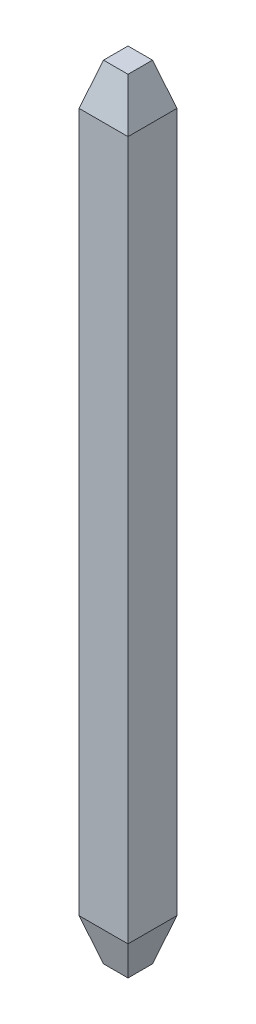
ISO-10303-21;
HEADER;
FILE_DESCRIPTION(('STEP AP214'),'2;1');
FILE_NAME('part.step','',(''),(''),'','','');
FILE_SCHEMA(('AUTOMOTIVE_DESIGN { 1 0 10303 214 1 1 1 1 }'));
ENDSEC;
DATA;
#1=APPLICATION_CONTEXT('core data for automotive mechanical design processes');
#2=APPLICATION_PROTOCOL_DEFINITION('international standard','automotive_design',2000,#1);
#3=PRODUCT_CONTEXT('',#1,'mechanical');
#4=PRODUCT('Part','Part','',(#3));
#5=PRODUCT_RELATED_PRODUCT_CATEGORY('part','',(#4));
#6=PRODUCT_DEFINITION_FORMATION('','',#4);
#7=PRODUCT_DEFINITION_CONTEXT('part definition',#1,'design');
#8=PRODUCT_DEFINITION('design','',#6,#7);
#9=PRODUCT_DEFINITION_SHAPE('','',#8);
#10=(LENGTH_UNIT() NAMED_UNIT(*) SI_UNIT(.MILLI.,.METRE.));
#11=(NAMED_UNIT(*) PLANE_ANGLE_UNIT() SI_UNIT($,.RADIAN.));
#12=(NAMED_UNIT(*) SI_UNIT($,.STERADIAN.) SOLID_ANGLE_UNIT());
#13=UNCERTAINTY_MEASURE_WITH_UNIT(LENGTH_MEASURE(1.E-05),#10,'distance_accuracy_value','');
#14=(GEOMETRIC_REPRESENTATION_CONTEXT(3) GLOBAL_UNCERTAINTY_ASSIGNED_CONTEXT((#13)) GLOBAL_UNIT_ASSIGNED_CONTEXT((#10,
#11,#12)) REPRESENTATION_CONTEXT('',''));
#15=CARTESIAN_POINT('',(0.,0.,0.));
#16=DIRECTION('',(0.,0.,1.));
#17=DIRECTION('',(1.,0.,0.));
#18=AXIS2_PLACEMENT_3D('',#15,#16,#17);
#19=CARTESIAN_POINT('',(-13.489999999987,-10.1039999999832,-19.5199999999763));
#20=DIRECTION('',(0.959644900900969,-0.28121462297464,0.));
#21=DIRECTION('',(0.,0.,-1.));
#22=AXIS2_PLACEMENT_3D('',#19,#20,#21);
#23=PLANE('',#22);
#24=DIRECTION('',(0.,0.,1.));
#25=VECTOR('',#24,1.);
#26=CARTESIAN_POINT('',(-13.489999999987,-10.1039999999832,-19.8399999999763));
#27=LINE('',#26,#25);
#28=CARTESIAN_POINT('',(-13.489999999987,-10.1039999999832,-19.8399999999763));
#29=VERTEX_POINT('',#28);
#30=CARTESIAN_POINT('',(-13.489999999987,-10.1039999999832,-19.1999999999763));
#31=VERTEX_POINT('',#30);
#32=EDGE_CURVE('E11',#29,#31,#27,.T.);
#33=ORIENTED_EDGE('',*,*,#32,.T.);
#34=DIRECTION('',(-0.270714017147724,-0.923811583516618,-0.270714017147727));
#35=VECTOR('',#34,1.);
#36=CARTESIAN_POINT('',(-13.489999999987,-10.1039999999832,-19.1999999999763));
#37=LINE('',#36,#35);
#38=CARTESIAN_POINT('',(-13.649999999987,-10.6499999999832,-19.3599999999763));
#39=VERTEX_POINT('',#38);
#40=EDGE_CURVE('E28',#31,#39,#37,.T.);
#41=ORIENTED_EDGE('',*,*,#40,.T.);
#42=DIRECTION('',(0.,0.,1.));
#43=VECTOR('',#42,1.);
#44=CARTESIAN_POINT('',(-13.649999999987,-10.6499999999832,-19.6799999999763));
#45=LINE('',#44,#43);
#46=CARTESIAN_POINT('',(-13.649999999987,-10.6499999999832,-19.6799999999763));
#47=VERTEX_POINT('',#46);
#48=EDGE_CURVE('E158',#47,#39,#45,.T.);
#49=ORIENTED_EDGE('',*,*,#48,.F.);
#50=DIRECTION('',(-0.270714017147724,-0.923811583516618,0.270714017147727));
#51=VECTOR('',#50,1.);
#52=CARTESIAN_POINT('',(-13.489999999987,-10.1039999999832,-19.8399999999763));
#53=LINE('',#52,#51);
#54=EDGE_CURVE('E161',#29,#47,#53,.T.);
#55=ORIENTED_EDGE('',*,*,#54,.F.);
#56=EDGE_LOOP('',(#33,#41,#49,#55));
#57=FACE_BOUND('',#56,.T.);
#58=ADVANCED_FACE('F17',(#57),#23,.T.);
#59=CARTESIAN_POINT('',(-13.489999999987,-11.0738701069127,-19.5199999999763));
#60=DIRECTION('',(1.,0.,0.));
#61=DIRECTION('',(0.,1.,0.));
#62=AXIS2_PLACEMENT_3D('',#59,#60,#61);
#63=PLANE('',#62);
#64=DIRECTION('',(0.,1.,0.));
#65=VECTOR('',#64,1.);
#66=CARTESIAN_POINT('',(-13.489999999987,-10.1039999999832,-19.1999999999763));
#67=LINE('',#66,#65);
#68=CARTESIAN_POINT('',(-13.489999999987,-0.965870106912691,-19.1999999999763));
#69=VERTEX_POINT('',#68);
#70=EDGE_CURVE('E41',#31,#69,#67,.T.);
#71=ORIENTED_EDGE('',*,*,#70,.F.);
#72=ORIENTED_EDGE('',*,*,#32,.F.);
#73=DIRECTION('',(0.,1.,0.));
#74=VECTOR('',#73,1.);
#75=CARTESIAN_POINT('',(-13.489999999987,-10.1039999999832,-19.8399999999763));
#76=LINE('',#75,#74);
#77=CARTESIAN_POINT('',(-13.489999999987,-0.965870106912691,-19.8399999999763));
#78=VERTEX_POINT('',#77);
#79=EDGE_CURVE('E150',#29,#78,#76,.T.);
#80=ORIENTED_EDGE('',*,*,#79,.T.);
#81=DIRECTION('',(0.,0.,1.));
#82=VECTOR('',#81,1.);
#83=CARTESIAN_POINT('',(-13.489999999987,-0.965870106912693,-19.8399999999763));
#84=LINE('',#83,#82);
#85=EDGE_CURVE('E147',#78,#69,#84,.T.);
#86=ORIENTED_EDGE('',*,*,#85,.T.);
#87=EDGE_LOOP('',(#71,#72,#80,#86));
#88=FACE_BOUND('',#87,.T.);
#89=ADVANCED_FACE('F223',(#88),#63,.T.);
#90=CARTESIAN_POINT('',(-14.130999999987,-5.53543505344795,-19.1999999999763));
#91=DIRECTION('',(0.,0.,1.));
#92=DIRECTION('',(1.,0.,0.));
#93=AXIS2_PLACEMENT_3D('',#90,#91,#92);
#94=PLANE('',#93);
#95=DIRECTION('',(0.,1.,0.));
#96=VECTOR('',#95,1.);
#97=CARTESIAN_POINT('',(-14.129999999987,-10.1039999999832,-19.1999999999763));
#98=LINE('',#97,#96);
#99=CARTESIAN_POINT('',(-14.129999999987,-10.1039999999832,-19.1999999999763));
#100=VERTEX_POINT('',#99);
#101=CARTESIAN_POINT('',(-14.129999999987,-0.965870106912691,-19.1999999999763));
#102=VERTEX_POINT('',#101);
#103=EDGE_CURVE('E167',#100,#102,#98,.T.);
#104=ORIENTED_EDGE('',*,*,#103,.F.);
#105=DIRECTION('',(-1.,0.,0.));
#106=VECTOR('',#105,1.);
#107=CARTESIAN_POINT('',(-13.489999999987,-10.1039999999832,-19.1999999999763));
#108=LINE('',#107,#106);
#109=EDGE_CURVE('E154',#31,#100,#108,.T.);
#110=ORIENTED_EDGE('',*,*,#109,.F.);
#111=ORIENTED_EDGE('',*,*,#70,.T.);
#112=DIRECTION('',(-1.,0.,0.));
#113=VECTOR('',#112,1.);
#114=CARTESIAN_POINT('',(-13.489999999987,-0.965870106912693,-19.1999999999763));
#115=LINE('',#114,#113);
#116=EDGE_CURVE('E179',#69,#102,#115,.T.);
#117=ORIENTED_EDGE('',*,*,#116,.T.);
#118=EDGE_LOOP('',(#104,#110,#111,#117));
#119=FACE_BOUND('',#118,.T.);
#120=ADVANCED_FACE('F219',(#119),#94,.T.);
#121=CARTESIAN_POINT('',(-14.129999999987,-5.53543505344795,-19.1989999999763));
#122=DIRECTION('',(-1.,0.,0.));
#123=DIRECTION('',(0.,0.,1.));
#124=AXIS2_PLACEMENT_3D('',#121,#122,#123);
#125=PLANE('',#124);
#126=DIRECTION('',(0.,1.,0.));
#127=VECTOR('',#126,1.);
#128=CARTESIAN_POINT('',(-14.129999999987,-10.1039999999832,-19.8399999999763));
#129=LINE('',#128,#127);
#130=CARTESIAN_POINT('',(-14.129999999987,-10.1039999999832,-19.8399999999763));
#131=VERTEX_POINT('',#130);
#132=CARTESIAN_POINT('',(-14.129999999987,-0.965870106912691,-19.8399999999763));
#133=VERTEX_POINT('',#132);
#134=EDGE_CURVE('E146',#131,#133,#129,.T.);
#135=ORIENTED_EDGE('',*,*,#134,.F.);
#136=DIRECTION('',(0.,0.,-1.));
#137=VECTOR('',#136,1.);
#138=CARTESIAN_POINT('',(-14.129999999987,-10.1039999999832,-19.1999999999763));
#139=LINE('',#138,#137);
#140=EDGE_CURVE('E164',#100,#131,#139,.T.);
#141=ORIENTED_EDGE('',*,*,#140,.F.);
#142=ORIENTED_EDGE('',*,*,#103,.T.);
#143=DIRECTION('',(0.,0.,-1.));
#144=VECTOR('',#143,1.);
#145=CARTESIAN_POINT('',(-14.129999999987,-0.965870106912693,-19.1999999999763));
#146=LINE('',#145,#144);
#147=EDGE_CURVE('E121',#102,#133,#146,.T.);
#148=ORIENTED_EDGE('',*,*,#147,.T.);
#149=EDGE_LOOP('',(#135,#141,#142,#148));
#150=FACE_BOUND('',#149,.T.);
#151=ADVANCED_FACE('F214',(#150),#125,.T.);
#152=CARTESIAN_POINT('',(-14.129999999987,-0.965870106912693,-19.5199999999763));
#153=DIRECTION('',(-0.959644900900968,0.281214622974643,0.));
#154=DIRECTION('',(0.,0.,1.));
#155=AXIS2_PLACEMENT_3D('',#152,#153,#154);
#156=PLANE('',#155);
#157=DIRECTION('',(0.270714017147727,0.923811583516618,-0.270714017147727));
#158=VECTOR('',#157,1.);
#159=CARTESIAN_POINT('',(-14.129999999987,-0.965870106912693,-19.1999999999763));
#160=LINE('',#159,#158);
#161=CARTESIAN_POINT('',(-13.969999999987,-0.419870106912695,-19.3599999999763));
#162=VERTEX_POINT('',#161);
#163=EDGE_CURVE('E115',#102,#162,#160,.T.);
#164=ORIENTED_EDGE('',*,*,#163,.T.);
#165=DIRECTION('',(0.,0.,-1.));
#166=VECTOR('',#165,1.);
#167=CARTESIAN_POINT('',(-13.969999999987,-0.419870106912693,-19.3599999999763));
#168=LINE('',#167,#166);
#169=CARTESIAN_POINT('',(-13.969999999987,-0.419870106912695,-19.6799999999763));
#170=VERTEX_POINT('',#169);
#171=EDGE_CURVE('E103',#162,#170,#168,.T.);
#172=ORIENTED_EDGE('',*,*,#171,.T.);
#173=DIRECTION('',(0.270714017147727,0.923811583516618,0.270714017147727));
#174=VECTOR('',#173,1.);
#175=CARTESIAN_POINT('',(-14.129999999987,-0.965870106912693,-19.8399999999763));
#176=LINE('',#175,#174);
#177=EDGE_CURVE('E116',#133,#170,#176,.T.);
#178=ORIENTED_EDGE('',*,*,#177,.F.);
#179=ORIENTED_EDGE('',*,*,#147,.F.);
#180=EDGE_LOOP('',(#164,#172,#178,#179));
#181=FACE_BOUND('',#180,.T.);
#182=ADVANCED_FACE('F119',(#181),#156,.T.);
#183=CARTESIAN_POINT('',(-13.809999999987,-0.965870106912693,-19.8399999999763));
#184=DIRECTION('',(0.,0.281214622974643,-0.959644900900968));
#185=DIRECTION('',(-1.,0.,0.));
#186=AXIS2_PLACEMENT_3D('',#183,#184,#185);
#187=PLANE('',#186);
#188=ORIENTED_EDGE('',*,*,#177,.T.);
#189=DIRECTION('',(1.,0.,0.));
#190=VECTOR('',#189,1.);
#191=CARTESIAN_POINT('',(-13.969999999987,-0.419870106912693,-19.6799999999763));
#192=LINE('',#191,#190);
#193=CARTESIAN_POINT('',(-13.649999999987,-0.419870106912695,-19.6799999999763));
#194=VERTEX_POINT('',#193);
#195=EDGE_CURVE('E111',#170,#194,#192,.T.);
#196=ORIENTED_EDGE('',*,*,#195,.T.);
#197=DIRECTION('',(-0.270714017147724,0.923811583516618,0.270714017147727));
#198=VECTOR('',#197,1.);
#199=CARTESIAN_POINT('',(-13.489999999987,-0.965870106912693,-19.8399999999763));
#200=LINE('',#199,#198);
#201=EDGE_CURVE('E129',#78,#194,#200,.T.);
#202=ORIENTED_EDGE('',*,*,#201,.F.);
#203=DIRECTION('',(1.,0.,0.));
#204=VECTOR('',#203,1.);
#205=CARTESIAN_POINT('',(-14.129999999987,-0.965870106912693,-19.8399999999763));
#206=LINE('',#205,#204);
#207=EDGE_CURVE('E175',#133,#78,#206,.T.);
#208=ORIENTED_EDGE('',*,*,#207,.F.);
#209=EDGE_LOOP('',(#188,#196,#202,#208));
#210=FACE_BOUND('',#209,.T.);
#211=ADVANCED_FACE('F274',(#210),#187,.T.);
#212=CARTESIAN_POINT('',(-13.809999999987,-0.419870106912693,-19.6809999999763));
#213=DIRECTION('',(0.,1.,0.));
#214=DIRECTION('',(1.,0.,0.));
#215=AXIS2_PLACEMENT_3D('',#212,#213,#214);
#216=PLANE('',#215);
#217=ORIENTED_EDGE('',*,*,#195,.F.);
#218=ORIENTED_EDGE('',*,*,#171,.F.);
#219=DIRECTION('',(-1.,0.,0.));
#220=VECTOR('',#219,1.);
#221=CARTESIAN_POINT('',(-13.649999999987,-0.419870106912693,-19.3599999999763));
#222=LINE('',#221,#220);
#223=CARTESIAN_POINT('',(-13.649999999987,-0.419870106912695,-19.3599999999763));
#224=VERTEX_POINT('',#223);
#225=EDGE_CURVE('E108',#224,#162,#222,.T.);
#226=ORIENTED_EDGE('',*,*,#225,.F.);
#227=DIRECTION('',(0.,0.,1.));
#228=VECTOR('',#227,1.);
#229=CARTESIAN_POINT('',(-13.649999999987,-0.419870106912693,-19.6799999999763));
#230=LINE('',#229,#228);
#231=EDGE_CURVE('E139',#194,#224,#230,.T.);
#232=ORIENTED_EDGE('',*,*,#231,.F.);
#233=EDGE_LOOP('',(#217,#218,#226,#232));
#234=FACE_BOUND('',#233,.T.);
#235=ADVANCED_FACE('F105',(#234),#216,.T.);
#236=CARTESIAN_POINT('',(-14.129999999987,-10.1039999999832,-19.5199999999763));
#237=DIRECTION('',(-0.959644900900968,-0.281214622974643,0.));
#238=DIRECTION('',(-0.281214622974643,0.959644900900968,0.));
#239=AXIS2_PLACEMENT_3D('',#236,#237,#238);
#240=PLANE('',#239);
#241=ORIENTED_EDGE('',*,*,#140,.T.);
#242=DIRECTION('',(0.270714017147727,-0.923811583516618,0.270714017147727));
#243=VECTOR('',#242,1.);
#244=CARTESIAN_POINT('',(-14.129999999987,-10.1039999999832,-19.8399999999763));
#245=LINE('',#244,#243);
#246=CARTESIAN_POINT('',(-13.969999999987,-10.6499999999832,-19.6799999999763));
#247=VERTEX_POINT('',#246);
#248=EDGE_CURVE('E136',#131,#247,#245,.T.);
#249=ORIENTED_EDGE('',*,*,#248,.T.);
#250=DIRECTION('',(0.,0.,-1.));
#251=VECTOR('',#250,1.);
#252=CARTESIAN_POINT('',(-13.969999999987,-10.6499999999832,-19.3599999999763));
#253=LINE('',#252,#251);
#254=CARTESIAN_POINT('',(-13.969999999987,-10.6499999999832,-19.3599999999763));
#255=VERTEX_POINT('',#254);
#256=EDGE_CURVE('E171',#255,#247,#253,.T.);
#257=ORIENTED_EDGE('',*,*,#256,.F.);
#258=DIRECTION('',(0.270714017147727,-0.923811583516618,-0.270714017147727));
#259=VECTOR('',#258,1.);
#260=CARTESIAN_POINT('',(-14.129999999987,-10.1039999999832,-19.1999999999763));
#261=LINE('',#260,#259);
#262=EDGE_CURVE('E151',#100,#255,#261,.T.);
#263=ORIENTED_EDGE('',*,*,#262,.F.);
#264=EDGE_LOOP('',(#241,#249,#257,#263));
#265=FACE_BOUND('',#264,.T.);
#266=ADVANCED_FACE('F342',(#265),#240,.T.);
#267=CARTESIAN_POINT('',(-13.809999999987,-0.965870106912693,-19.1999999999763));
#268=DIRECTION('',(0.,0.281214622974643,0.959644900900968));
#269=DIRECTION('',(1.,0.,0.));
#270=AXIS2_PLACEMENT_3D('',#267,#268,#269);
#271=PLANE('',#270);
#272=DIRECTION('',(-0.270714017147724,0.923811583516618,-0.270714017147727));
#273=VECTOR('',#272,1.);
#274=CARTESIAN_POINT('',(-13.489999999987,-0.965870106912693,-19.1999999999763));
#275=LINE('',#274,#273);
#276=EDGE_CURVE('E127',#69,#224,#275,.T.);
#277=ORIENTED_EDGE('',*,*,#276,.T.);
#278=ORIENTED_EDGE('',*,*,#225,.T.);
#279=ORIENTED_EDGE('',*,*,#163,.F.);
#280=ORIENTED_EDGE('',*,*,#116,.F.);
#281=EDGE_LOOP('',(#277,#278,#279,#280));
#282=FACE_BOUND('',#281,.T.);
#283=ADVANCED_FACE('F19',(#282),#271,.T.);
#284=CARTESIAN_POINT('',(-13.489999999987,-0.965870106912693,-19.5199999999763));
#285=DIRECTION('',(0.95964490090097,0.281214622974639,0.));
#286=DIRECTION('',(0.,0.,-1.));
#287=AXIS2_PLACEMENT_3D('',#284,#285,#286);
#288=PLANE('',#287);
#289=ORIENTED_EDGE('',*,*,#201,.T.);
#290=ORIENTED_EDGE('',*,*,#231,.T.);
#291=ORIENTED_EDGE('',*,*,#276,.F.);
#292=ORIENTED_EDGE('',*,*,#85,.F.);
#293=EDGE_LOOP('',(#289,#290,#291,#292));
#294=FACE_BOUND('',#293,.T.);
#295=ADVANCED_FACE('F226',(#294),#288,.T.);
#296=CARTESIAN_POINT('',(-13.488999999987,-5.53443505344795,-19.8399999999763));
#297=DIRECTION('',(0.,0.,-1.));
#298=DIRECTION('',(0.,-1.,0.));
#299=AXIS2_PLACEMENT_3D('',#296,#297,#298);
#300=PLANE('',#299);
#301=ORIENTED_EDGE('',*,*,#79,.F.);
#302=DIRECTION('',(1.,0.,0.));
#303=VECTOR('',#302,1.);
#304=CARTESIAN_POINT('',(-14.129999999987,-10.1039999999832,-19.8399999999763));
#305=LINE('',#304,#303);
#306=EDGE_CURVE('E189',#131,#29,#305,.T.);
#307=ORIENTED_EDGE('',*,*,#306,.F.);
#308=ORIENTED_EDGE('',*,*,#134,.T.);
#309=ORIENTED_EDGE('',*,*,#207,.T.);
#310=EDGE_LOOP('',(#301,#307,#308,#309));
#311=FACE_BOUND('',#310,.T.);
#312=ADVANCED_FACE('F348',(#311),#300,.T.);
#313=CARTESIAN_POINT('',(-13.809999999987,-10.1039999999832,-19.8399999999763));
#314=DIRECTION('',(0.,-0.281214622974643,-0.959644900900968));
#315=DIRECTION('',(0.,-0.959644900900968,0.281214622974643));
#316=AXIS2_PLACEMENT_3D('',#313,#314,#315);
#317=PLANE('',#316);
#318=ORIENTED_EDGE('',*,*,#306,.T.);
#319=ORIENTED_EDGE('',*,*,#54,.T.);
#320=DIRECTION('',(1.,0.,0.));
#321=VECTOR('',#320,1.);
#322=CARTESIAN_POINT('',(-13.969999999987,-10.6499999999832,-19.6799999999763));
#323=LINE('',#322,#321);
#324=EDGE_CURVE('E168',#247,#47,#323,.T.);
#325=ORIENTED_EDGE('',*,*,#324,.F.);
#326=ORIENTED_EDGE('',*,*,#248,.F.);
#327=EDGE_LOOP('',(#318,#319,#325,#326));
#328=FACE_BOUND('',#327,.T.);
#329=ADVANCED_FACE('F353',(#328),#317,.T.);
#330=CARTESIAN_POINT('',(-13.970999999987,-10.6499999999832,-19.5199999999763));
#331=DIRECTION('',(0.,-1.,0.));
#332=DIRECTION('',(0.,0.,-1.));
#333=AXIS2_PLACEMENT_3D('',#330,#331,#332);
#334=PLANE('',#333);
#335=ORIENTED_EDGE('',*,*,#48,.T.);
#336=DIRECTION('',(-1.,0.,0.));
#337=VECTOR('',#336,1.);
#338=CARTESIAN_POINT('',(-13.649999999987,-10.6499999999832,-19.3599999999763));
#339=LINE('',#338,#337);
#340=EDGE_CURVE('E21',#39,#255,#339,.T.);
#341=ORIENTED_EDGE('',*,*,#340,.T.);
#342=ORIENTED_EDGE('',*,*,#256,.T.);
#343=ORIENTED_EDGE('',*,*,#324,.T.);
#344=EDGE_LOOP('',(#335,#341,#342,#343));
#345=FACE_BOUND('',#344,.T.);
#346=ADVANCED_FACE('F374',(#345),#334,.T.);
#347=CARTESIAN_POINT('',(-13.809999999987,-10.1039999999832,-19.1999999999763));
#348=DIRECTION('',(0.,-0.281214622974643,0.959644900900968));
#349=DIRECTION('',(-1.,0.,0.));
#350=AXIS2_PLACEMENT_3D('',#347,#348,#349);
#351=PLANE('',#350);
#352=ORIENTED_EDGE('',*,*,#109,.T.);
#353=ORIENTED_EDGE('',*,*,#262,.T.);
#354=ORIENTED_EDGE('',*,*,#340,.F.);
#355=ORIENTED_EDGE('',*,*,#40,.F.);
#356=EDGE_LOOP('',(#352,#353,#354,#355));
#357=FACE_BOUND('',#356,.T.);
#358=ADVANCED_FACE('F379',(#357),#351,.T.);
#359=CLOSED_SHELL('',(#58,#89,#120,#151,#182,#211,#235,#266,#283,#295,#312,#329,#346,#358));
#360=MANIFOLD_SOLID_BREP('B1',#359);
#361=ADVANCED_BREP_SHAPE_REPRESENTATION('',(#18,#360),#14);
#362=SHAPE_DEFINITION_REPRESENTATION(#9,#361);
ENDSEC;
END-ISO-10303-21;
